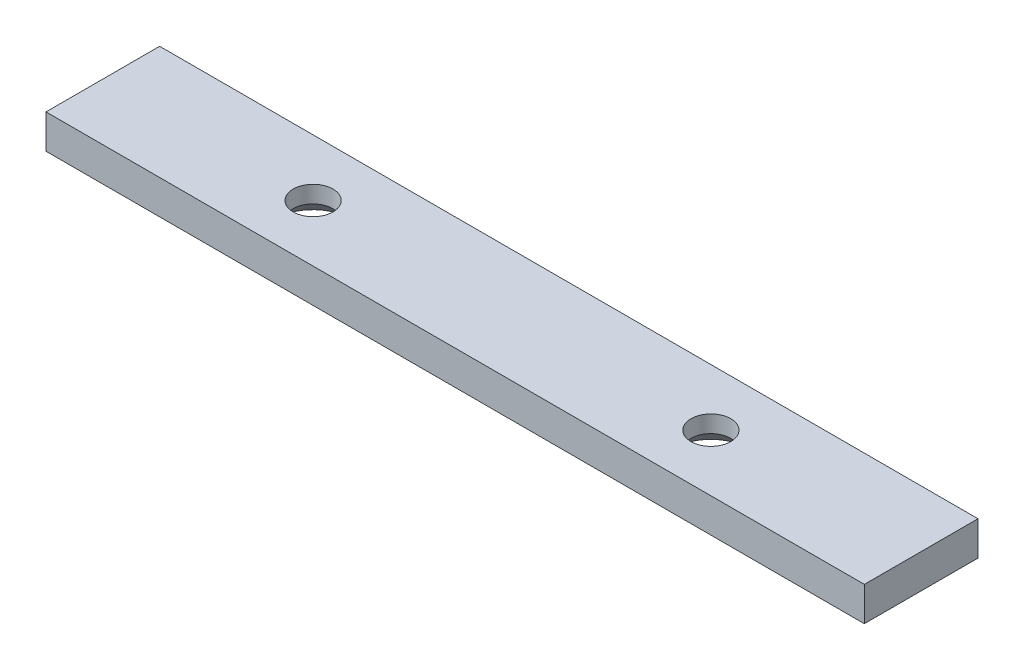
ISO-10303-21;
HEADER;
FILE_DESCRIPTION(('STEP AP214'),'2;1');
FILE_NAME('part.step','',(''),(''),'','','');
FILE_SCHEMA(('AUTOMOTIVE_DESIGN { 1 0 10303 214 1 1 1 1 }'));
ENDSEC;
DATA;
#1=APPLICATION_CONTEXT('core data for automotive mechanical design processes');
#2=APPLICATION_PROTOCOL_DEFINITION('international standard','automotive_design',2000,#1);
#3=PRODUCT_CONTEXT('',#1,'mechanical');
#4=PRODUCT('Part','Part','',(#3));
#5=PRODUCT_RELATED_PRODUCT_CATEGORY('part','',(#4));
#6=PRODUCT_DEFINITION_FORMATION('','',#4);
#7=PRODUCT_DEFINITION_CONTEXT('part definition',#1,'design');
#8=PRODUCT_DEFINITION('design','',#6,#7);
#9=PRODUCT_DEFINITION_SHAPE('','',#8);
#10=(LENGTH_UNIT() NAMED_UNIT(*) SI_UNIT(.MILLI.,.METRE.));
#11=(NAMED_UNIT(*) PLANE_ANGLE_UNIT() SI_UNIT($,.RADIAN.));
#12=(NAMED_UNIT(*) SI_UNIT($,.STERADIAN.) SOLID_ANGLE_UNIT());
#13=UNCERTAINTY_MEASURE_WITH_UNIT(LENGTH_MEASURE(1.E-05),#10,'distance_accuracy_value','');
#14=(GEOMETRIC_REPRESENTATION_CONTEXT(3) GLOBAL_UNCERTAINTY_ASSIGNED_CONTEXT((#13)) GLOBAL_UNIT_ASSIGNED_CONTEXT((#10,
#11,#12)) REPRESENTATION_CONTEXT('',''));
#15=CARTESIAN_POINT('',(0.,0.,0.));
#16=DIRECTION('',(0.,0.,1.));
#17=DIRECTION('',(1.,0.,0.));
#18=AXIS2_PLACEMENT_3D('',#15,#16,#17);
#19=CARTESIAN_POINT('',(0.,6.,0.));
#20=DIRECTION('',(0.,-1.,0.));
#21=DIRECTION('',(0.,0.,-1.));
#22=AXIS2_PLACEMENT_3D('',#19,#20,#21);
#23=PLANE('',#22);
#24=CARTESIAN_POINT('',(0.,6.,0.));
#25=DIRECTION('',(0.,1.,0.));
#26=DIRECTION('',(0.,0.,1.));
#27=AXIS2_PLACEMENT_3D('',#24,#25,#26);
#28=CIRCLE('',#27,3.5);
#29=CARTESIAN_POINT('',(0.,6.,3.5));
#30=VERTEX_POINT('',#29);
#31=EDGE_CURVE('E119',#30,#30,#28,.T.);
#32=ORIENTED_EDGE('',*,*,#31,.F.);
#33=EDGE_LOOP('',(#32));
#34=FACE_BOUND('',#33,.T.);
#35=DIRECTION('',(0.,0.,1.));
#36=VECTOR('',#35,1.);
#37=CARTESIAN_POINT('',(-107.,6.,-9.99999999999998));
#38=LINE('',#37,#36);
#39=CARTESIAN_POINT('',(-107.,6.,-9.99999999999998));
#40=VERTEX_POINT('',#39);
#41=CARTESIAN_POINT('',(-107.,6.,10.));
#42=VERTEX_POINT('',#41);
#43=EDGE_CURVE('E96',#40,#42,#38,.T.);
#44=ORIENTED_EDGE('',*,*,#43,.T.);
#45=DIRECTION('',(1.,0.,0.));
#46=VECTOR('',#45,1.);
#47=CARTESIAN_POINT('',(37.,6.,9.99999999999999));
#48=LINE('',#47,#46);
#49=CARTESIAN_POINT('',(37.,6.,9.99999999999999));
#50=VERTEX_POINT('',#49);
#51=EDGE_CURVE('E91',#42,#50,#48,.T.);
#52=ORIENTED_EDGE('',*,*,#51,.T.);
#53=DIRECTION('',(0.,0.,-1.));
#54=VECTOR('',#53,1.);
#55=CARTESIAN_POINT('',(37.,6.,-10.));
#56=LINE('',#55,#54);
#57=CARTESIAN_POINT('',(37.,6.,-10.));
#58=VERTEX_POINT('',#57);
#59=EDGE_CURVE('E94',#50,#58,#56,.T.);
#60=ORIENTED_EDGE('',*,*,#59,.T.);
#61=DIRECTION('',(-1.,0.,0.));
#62=VECTOR('',#61,1.);
#63=CARTESIAN_POINT('',(37.,6.,-10.));
#64=LINE('',#63,#62);
#65=EDGE_CURVE('E60',#58,#40,#64,.T.);
#66=ORIENTED_EDGE('',*,*,#65,.T.);
#67=EDGE_LOOP('',(#44,#52,#60,#66));
#68=FACE_BOUND('',#67,.T.);
#69=CARTESIAN_POINT('',(-70.,6.,0.));
#70=DIRECTION('',(0.,1.,0.));
#71=DIRECTION('',(0.,0.,1.));
#72=AXIS2_PLACEMENT_3D('',#69,#70,#71);
#73=CIRCLE('',#72,3.50000000000001);
#74=CARTESIAN_POINT('',(-70.,6.,3.50000000000002));
#75=VERTEX_POINT('',#74);
#76=EDGE_CURVE('E248',#75,#75,#73,.T.);
#77=ORIENTED_EDGE('',*,*,#76,.F.);
#78=EDGE_LOOP('',(#77));
#79=FACE_BOUND('',#78,.T.);
#80=ADVANCED_FACE('F42',(#34,#68,#79),#23,.F.);
#81=CARTESIAN_POINT('',(0.,0.,0.));
#82=DIRECTION('',(0.,-1.,0.));
#83=DIRECTION('',(0.,0.,-1.));
#84=AXIS2_PLACEMENT_3D('',#81,#82,#83);
#85=PLANE('',#84);
#86=CARTESIAN_POINT('',(-70.,0.,0.));
#87=DIRECTION('',(0.,-1.,0.));
#88=DIRECTION('',(0.,0.,-1.));
#89=AXIS2_PLACEMENT_3D('',#86,#87,#88);
#90=CIRCLE('',#89,6.50000000000001);
#91=CARTESIAN_POINT('',(-70.,0.,-6.5));
#92=VERTEX_POINT('',#91);
#93=EDGE_CURVE('E136',#92,#92,#90,.F.);
#94=ORIENTED_EDGE('',*,*,#93,.T.);
#95=EDGE_LOOP('',(#94));
#96=FACE_BOUND('',#95,.T.);
#97=CARTESIAN_POINT('',(0.,0.,0.));
#98=DIRECTION('',(0.,-1.,0.));
#99=DIRECTION('',(0.,0.,-1.));
#100=AXIS2_PLACEMENT_3D('',#97,#98,#99);
#101=CIRCLE('',#100,6.49999999999996);
#102=CARTESIAN_POINT('',(0.,0.,-6.49999999999996));
#103=VERTEX_POINT('',#102);
#104=EDGE_CURVE('E132',#103,#103,#101,.F.);
#105=ORIENTED_EDGE('',*,*,#104,.T.);
#106=EDGE_LOOP('',(#105));
#107=FACE_BOUND('',#106,.T.);
#108=DIRECTION('',(0.,0.,1.));
#109=VECTOR('',#108,1.);
#110=CARTESIAN_POINT('',(-107.,0.,-9.99999999999998));
#111=LINE('',#110,#109);
#112=CARTESIAN_POINT('',(-107.,0.,-9.99999999999998));
#113=VERTEX_POINT('',#112);
#114=CARTESIAN_POINT('',(-107.,0.,10.));
#115=VERTEX_POINT('',#114);
#116=EDGE_CURVE('E115',#113,#115,#111,.T.);
#117=ORIENTED_EDGE('',*,*,#116,.F.);
#118=DIRECTION('',(-1.,0.,0.));
#119=VECTOR('',#118,1.);
#120=CARTESIAN_POINT('',(37.,0.,-10.));
#121=LINE('',#120,#119);
#122=CARTESIAN_POINT('',(37.,0.,-10.));
#123=VERTEX_POINT('',#122);
#124=EDGE_CURVE('E83',#123,#113,#121,.T.);
#125=ORIENTED_EDGE('',*,*,#124,.F.);
#126=DIRECTION('',(0.,0.,-1.));
#127=VECTOR('',#126,1.);
#128=CARTESIAN_POINT('',(37.,0.,-10.));
#129=LINE('',#128,#127);
#130=CARTESIAN_POINT('',(37.,0.,9.99999999999999));
#131=VERTEX_POINT('',#130);
#132=EDGE_CURVE('E77',#131,#123,#129,.T.);
#133=ORIENTED_EDGE('',*,*,#132,.F.);
#134=DIRECTION('',(1.,0.,0.));
#135=VECTOR('',#134,1.);
#136=CARTESIAN_POINT('',(37.,0.,9.99999999999999));
#137=LINE('',#136,#135);
#138=EDGE_CURVE('E102',#115,#131,#137,.T.);
#139=ORIENTED_EDGE('',*,*,#138,.F.);
#140=EDGE_LOOP('',(#117,#125,#133,#139));
#141=FACE_BOUND('',#140,.T.);
#142=ADVANCED_FACE('F151',(#96,#107,#141),#85,.T.);
#143=CARTESIAN_POINT('',(-107.,6.,-9.99999999999998));
#144=DIRECTION('',(1.,0.,0.));
#145=DIRECTION('',(0.,0.,-1.));
#146=AXIS2_PLACEMENT_3D('',#143,#144,#145);
#147=PLANE('',#146);
#148=ORIENTED_EDGE('',*,*,#116,.T.);
#149=DIRECTION('',(0.,-1.,0.));
#150=VECTOR('',#149,1.);
#151=CARTESIAN_POINT('',(-107.,6.,10.));
#152=LINE('',#151,#150);
#153=EDGE_CURVE('E104',#42,#115,#152,.T.);
#154=ORIENTED_EDGE('',*,*,#153,.F.);
#155=ORIENTED_EDGE('',*,*,#43,.F.);
#156=DIRECTION('',(0.,-1.,0.));
#157=VECTOR('',#156,1.);
#158=CARTESIAN_POINT('',(-107.,6.,-9.99999999999998));
#159=LINE('',#158,#157);
#160=EDGE_CURVE('E111',#40,#113,#159,.T.);
#161=ORIENTED_EDGE('',*,*,#160,.T.);
#162=EDGE_LOOP('',(#148,#154,#155,#161));
#163=FACE_BOUND('',#162,.T.);
#164=ADVANCED_FACE('F154',(#163),#147,.F.);
#165=CARTESIAN_POINT('',(37.,6.,9.99999999999999));
#166=DIRECTION('',(0.,0.,-1.));
#167=DIRECTION('',(-1.,0.,0.));
#168=AXIS2_PLACEMENT_3D('',#165,#166,#167);
#169=PLANE('',#168);
#170=ORIENTED_EDGE('',*,*,#138,.T.);
#171=DIRECTION('',(0.,-1.,0.));
#172=VECTOR('',#171,1.);
#173=CARTESIAN_POINT('',(37.,6.,9.99999999999999));
#174=LINE('',#173,#172);
#175=EDGE_CURVE('E100',#50,#131,#174,.T.);
#176=ORIENTED_EDGE('',*,*,#175,.F.);
#177=ORIENTED_EDGE('',*,*,#51,.F.);
#178=ORIENTED_EDGE('',*,*,#153,.T.);
#179=EDGE_LOOP('',(#170,#176,#177,#178));
#180=FACE_BOUND('',#179,.T.);
#181=ADVANCED_FACE('F101',(#180),#169,.F.);
#182=CARTESIAN_POINT('',(37.,6.,-10.));
#183=DIRECTION('',(-1.,0.,0.));
#184=DIRECTION('',(0.,0.,1.));
#185=AXIS2_PLACEMENT_3D('',#182,#183,#184);
#186=PLANE('',#185);
#187=ORIENTED_EDGE('',*,*,#132,.T.);
#188=DIRECTION('',(0.,-1.,0.));
#189=VECTOR('',#188,1.);
#190=CARTESIAN_POINT('',(37.,6.,-10.));
#191=LINE('',#190,#189);
#192=EDGE_CURVE('E105',#58,#123,#191,.T.);
#193=ORIENTED_EDGE('',*,*,#192,.F.);
#194=ORIENTED_EDGE('',*,*,#59,.F.);
#195=ORIENTED_EDGE('',*,*,#175,.T.);
#196=EDGE_LOOP('',(#187,#193,#194,#195));
#197=FACE_BOUND('',#196,.T.);
#198=ADVANCED_FACE('F107',(#197),#186,.F.);
#199=CARTESIAN_POINT('',(37.,6.,-10.));
#200=DIRECTION('',(0.,0.,1.));
#201=DIRECTION('',(1.,0.,0.));
#202=AXIS2_PLACEMENT_3D('',#199,#200,#201);
#203=PLANE('',#202);
#204=ORIENTED_EDGE('',*,*,#124,.T.);
#205=ORIENTED_EDGE('',*,*,#160,.F.);
#206=ORIENTED_EDGE('',*,*,#65,.F.);
#207=ORIENTED_EDGE('',*,*,#192,.T.);
#208=EDGE_LOOP('',(#204,#205,#206,#207));
#209=FACE_BOUND('',#208,.T.);
#210=ADVANCED_FACE('F160',(#209),#203,.F.);
#211=CARTESIAN_POINT('',(0.,6.,0.));
#212=DIRECTION('',(0.,-1.,0.));
#213=DIRECTION('',(0.,0.,-1.));
#214=AXIS2_PLACEMENT_3D('',#211,#212,#213);
#215=CYLINDRICAL_SURFACE('',#214,3.5);
#216=CARTESIAN_POINT('',(0.,2.99999999999997,0.));
#217=DIRECTION('',(0.,-1.,0.));
#218=DIRECTION('',(0.,0.,-1.));
#219=AXIS2_PLACEMENT_3D('',#216,#217,#218);
#220=CIRCLE('',#219,3.5);
#221=CARTESIAN_POINT('',(0.,2.99999999999997,-3.5));
#222=VERTEX_POINT('',#221);
#223=EDGE_CURVE('E11',#222,#222,#220,.T.);
#224=ORIENTED_EDGE('',*,*,#223,.T.);
#225=EDGE_LOOP('',(#224));
#226=FACE_BOUND('',#225,.T.);
#227=ORIENTED_EDGE('',*,*,#31,.T.);
#228=EDGE_LOOP('',(#227));
#229=FACE_BOUND('',#228,.T.);
#230=ADVANCED_FACE('F162',(#226,#229),#215,.F.);
#231=CARTESIAN_POINT('',(-70.,6.,0.));
#232=DIRECTION('',(0.,-1.,0.));
#233=DIRECTION('',(0.,0.,-1.));
#234=AXIS2_PLACEMENT_3D('',#231,#232,#233);
#235=CYLINDRICAL_SURFACE('',#234,3.50000000000001);
#236=CARTESIAN_POINT('',(-70.,3.,0.));
#237=DIRECTION('',(0.,-1.,0.));
#238=DIRECTION('',(0.,0.,-1.));
#239=AXIS2_PLACEMENT_3D('',#236,#237,#238);
#240=CIRCLE('',#239,3.50000000000001);
#241=CARTESIAN_POINT('',(-70.,3.,-3.5));
#242=VERTEX_POINT('',#241);
#243=EDGE_CURVE('E52',#242,#242,#240,.T.);
#244=ORIENTED_EDGE('',*,*,#243,.T.);
#245=EDGE_LOOP('',(#244));
#246=FACE_BOUND('',#245,.T.);
#247=ORIENTED_EDGE('',*,*,#76,.T.);
#248=EDGE_LOOP('',(#247));
#249=FACE_BOUND('',#248,.T.);
#250=ADVANCED_FACE('F143',(#246,#249),#235,.F.);
#251=CARTESIAN_POINT('',(-70.,0.,0.));
#252=DIRECTION('',(0.,-1.,0.));
#253=DIRECTION('',(0.,0.,-1.));
#254=AXIS2_PLACEMENT_3D('',#251,#252,#253);
#255=CONICAL_SURFACE('',#254,6.50000000000001,0.785398163397448);
#256=ORIENTED_EDGE('',*,*,#243,.F.);
#257=EDGE_LOOP('',(#256));
#258=FACE_BOUND('',#257,.T.);
#259=ORIENTED_EDGE('',*,*,#93,.F.);
#260=EDGE_LOOP('',(#259));
#261=FACE_BOUND('',#260,.T.);
#262=ADVANCED_FACE('F146',(#258,#261),#255,.F.);
#263=CARTESIAN_POINT('',(0.,0.,0.));
#264=DIRECTION('',(0.,-1.,0.));
#265=DIRECTION('',(0.,0.,-1.));
#266=AXIS2_PLACEMENT_3D('',#263,#264,#265);
#267=CONICAL_SURFACE('',#266,6.49999999999996,0.785398163397448);
#268=ORIENTED_EDGE('',*,*,#223,.F.);
#269=EDGE_LOOP('',(#268));
#270=FACE_BOUND('',#269,.T.);
#271=ORIENTED_EDGE('',*,*,#104,.F.);
#272=EDGE_LOOP('',(#271));
#273=FACE_BOUND('',#272,.T.);
#274=ADVANCED_FACE('F44',(#270,#273),#267,.F.);
#275=CLOSED_SHELL('',(#80,#142,#164,#181,#198,#210,#230,#250,#262,#274));
#276=MANIFOLD_SOLID_BREP('B2',#275);
#277=ADVANCED_BREP_SHAPE_REPRESENTATION('',(#18,#276),#14);
#278=SHAPE_DEFINITION_REPRESENTATION(#9,#277);
ENDSEC;
END-ISO-10303-21;
